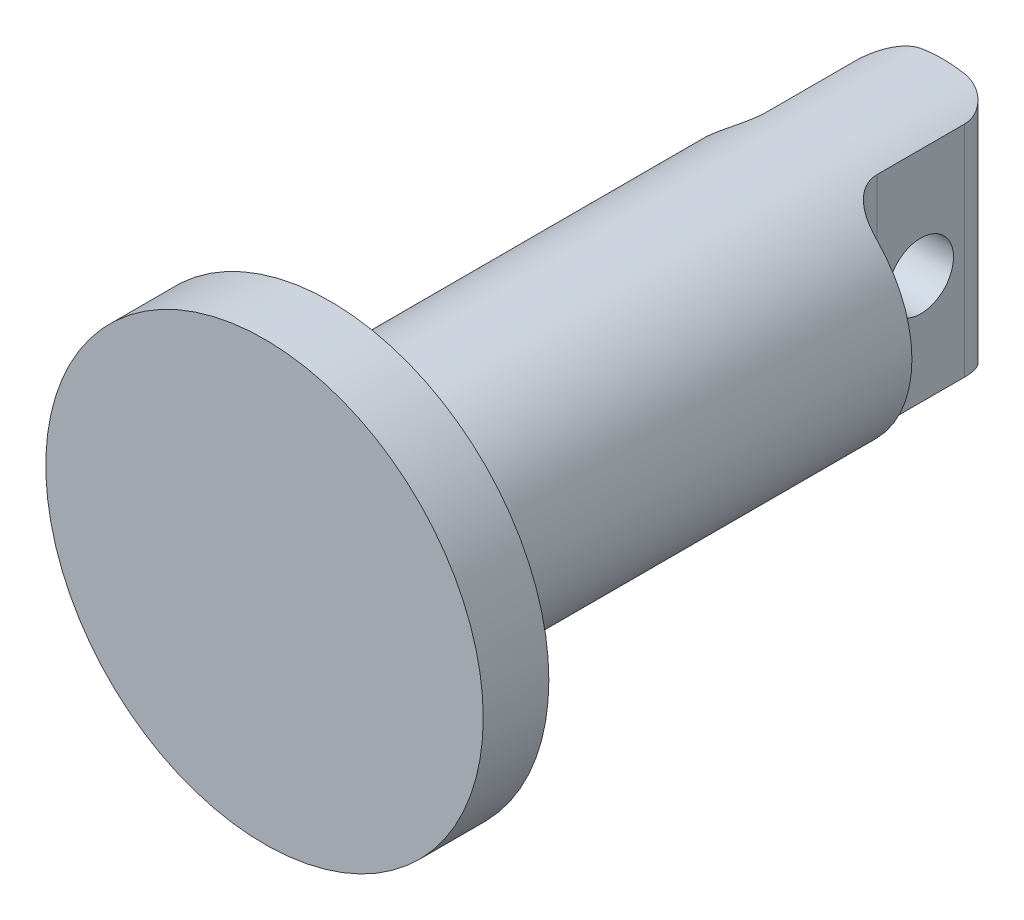
ISO-10303-21;
HEADER;
FILE_DESCRIPTION(('STEP AP214'),'2;1');
FILE_NAME('part.step','',(''),(''),'','','');
FILE_SCHEMA(('AUTOMOTIVE_DESIGN { 1 0 10303 214 1 1 1 1 }'));
ENDSEC;
DATA;
#1=APPLICATION_CONTEXT('core data for automotive mechanical design processes');
#2=APPLICATION_PROTOCOL_DEFINITION('international standard','automotive_design',2000,#1);
#3=PRODUCT_CONTEXT('',#1,'mechanical');
#4=PRODUCT('Part','Part','',(#3));
#5=PRODUCT_RELATED_PRODUCT_CATEGORY('part','',(#4));
#6=PRODUCT_DEFINITION_FORMATION('','',#4);
#7=PRODUCT_DEFINITION_CONTEXT('part definition',#1,'design');
#8=PRODUCT_DEFINITION('design','',#6,#7);
#9=PRODUCT_DEFINITION_SHAPE('','',#8);
#10=(LENGTH_UNIT() NAMED_UNIT(*) SI_UNIT(.MILLI.,.METRE.));
#11=(NAMED_UNIT(*) PLANE_ANGLE_UNIT() SI_UNIT($,.RADIAN.));
#12=(NAMED_UNIT(*) SI_UNIT($,.STERADIAN.) SOLID_ANGLE_UNIT());
#13=UNCERTAINTY_MEASURE_WITH_UNIT(LENGTH_MEASURE(1.E-05),#10,'distance_accuracy_value','');
#14=(GEOMETRIC_REPRESENTATION_CONTEXT(3) GLOBAL_UNCERTAINTY_ASSIGNED_CONTEXT((#13)) GLOBAL_UNIT_ASSIGNED_CONTEXT((#10,
#11,#12)) REPRESENTATION_CONTEXT('',''));
#15=CARTESIAN_POINT('',(0.,0.,0.));
#16=DIRECTION('',(0.,0.,1.));
#17=DIRECTION('',(1.,0.,0.));
#18=AXIS2_PLACEMENT_3D('',#15,#16,#17);
#19=CARTESIAN_POINT('',(0.,0.,0.));
#20=DIRECTION('',(0.,0.,1.));
#21=DIRECTION('',(1.,0.,0.));
#22=AXIS2_PLACEMENT_3D('',#19,#20,#21);
#23=PLANE('',#22);
#24=CARTESIAN_POINT('',(0.,0.,0.));
#25=DIRECTION('',(0.,0.,1.));
#26=DIRECTION('',(1.,0.,0.));
#27=AXIS2_PLACEMENT_3D('',#24,#25,#26);
#28=CIRCLE('',#27,8.6);
#29=CARTESIAN_POINT('',(8.6,0.,0.));
#30=VERTEX_POINT('',#29);
#31=EDGE_CURVE('E110',#30,#30,#28,.T.);
#32=ORIENTED_EDGE('',*,*,#31,.T.);
#33=EDGE_LOOP('',(#32));
#34=FACE_BOUND('',#33,.T.);
#35=CARTESIAN_POINT('',(0.,0.,0.));
#36=DIRECTION('',(0.,0.,1.));
#37=DIRECTION('',(1.,0.,0.));
#38=AXIS2_PLACEMENT_3D('',#35,#36,#37);
#39=CIRCLE('',#38,10.);
#40=CARTESIAN_POINT('',(10.,0.,0.));
#41=VERTEX_POINT('',#40);
#42=EDGE_CURVE('E242',#41,#41,#39,.T.);
#43=ORIENTED_EDGE('',*,*,#42,.F.);
#44=EDGE_LOOP('',(#43));
#45=FACE_BOUND('',#44,.T.);
#46=ADVANCED_FACE('F36',(#34,#45),#23,.F.);
#47=CARTESIAN_POINT('',(0.,0.,3.));
#48=DIRECTION('',(0.,0.,-1.));
#49=DIRECTION('',(-1.,0.,0.));
#50=AXIS2_PLACEMENT_3D('',#47,#48,#49);
#51=CYLINDRICAL_SURFACE('',#50,10.);
#52=CARTESIAN_POINT('',(0.,0.,3.));
#53=DIRECTION('',(0.,0.,1.));
#54=DIRECTION('',(1.,0.,0.));
#55=AXIS2_PLACEMENT_3D('',#52,#53,#54);
#56=CIRCLE('',#55,10.);
#57=CARTESIAN_POINT('',(10.,0.,3.));
#58=VERTEX_POINT('',#57);
#59=EDGE_CURVE('E363',#58,#58,#56,.T.);
#60=ORIENTED_EDGE('',*,*,#59,.F.);
#61=EDGE_LOOP('',(#60));
#62=FACE_BOUND('',#61,.T.);
#63=ORIENTED_EDGE('',*,*,#42,.T.);
#64=EDGE_LOOP('',(#63));
#65=FACE_BOUND('',#64,.T.);
#66=ADVANCED_FACE('F206',(#62,#65),#51,.T.);
#67=CARTESIAN_POINT('',(0.,0.,3.));
#68=DIRECTION('',(0.,0.,1.));
#69=DIRECTION('',(1.,0.,0.));
#70=AXIS2_PLACEMENT_3D('',#67,#68,#69);
#71=PLANE('',#70);
#72=ORIENTED_EDGE('',*,*,#59,.T.);
#73=EDGE_LOOP('',(#72));
#74=FACE_BOUND('',#73,.T.);
#75=ADVANCED_FACE('F155',(#74),#71,.T.);
#76=CARTESIAN_POINT('',(0.,0.,-28.));
#77=DIRECTION('',(0.,0.,1.));
#78=DIRECTION('',(1.,0.,0.));
#79=AXIS2_PLACEMENT_3D('',#76,#77,#78);
#80=CYLINDRICAL_SURFACE('',#79,5.6);
#81=CARTESIAN_POINT('',(0.,0.,-3.));
#82=DIRECTION('',(0.,0.,1.));
#83=DIRECTION('',(1.,0.,0.));
#84=AXIS2_PLACEMENT_3D('',#81,#82,#83);
#85=CIRCLE('',#84,5.6);
#86=CARTESIAN_POINT('',(5.6,0.,-3.));
#87=VERTEX_POINT('',#86);
#88=EDGE_CURVE('E125',#87,#87,#85,.F.);
#89=ORIENTED_EDGE('',*,*,#88,.T.);
#90=EDGE_LOOP('',(#89));
#91=FACE_BOUND('',#90,.T.);
#92=DIRECTION('',(0.,0.,1.));
#93=VECTOR('',#92,1.);
#94=CARTESIAN_POINT('',(-2.5,-5.01098792654702,-28.));
#95=LINE('',#94,#93);
#96=CARTESIAN_POINT('',(-2.5,-5.01098792654702,-22.5));
#97=VERTEX_POINT('',#96);
#98=CARTESIAN_POINT('',(-2.5,-5.01098792654702,-26.5));
#99=VERTEX_POINT('',#98);
#100=EDGE_CURVE('E108',#97,#99,#95,.F.);
#101=ORIENTED_EDGE('',*,*,#100,.T.);
#102=CARTESIAN_POINT('',(-2.5,-5.01098792654702,-26.5));
#103=CARTESIAN_POINT('',(-2.5000020804932,-5.01098386540568,-26.5395725011254));
#104=CARTESIAN_POINT('',(-2.49843294481036,-5.01177002350182,-26.5791239922962));
#105=CARTESIAN_POINT('',(-2.49218861536451,-5.01487928972236,-26.6579048751711));
#106=CARTESIAN_POINT('',(-2.48751464530948,-5.017201792326,-26.6971343876123));
#107=CARTESIAN_POINT('',(-2.46895310911888,-5.02637746679336,-26.8135594581204));
#108=CARTESIAN_POINT('',(-2.45052502289085,-5.03543974754558,-26.88991104718));
#109=CARTESIAN_POINT('',(-2.40237161237888,-5.05858790620674,-27.0379794446277));
#110=CARTESIAN_POINT('',(-2.37265886624782,-5.07266818985616,-27.1097013096591));
#111=CARTESIAN_POINT('',(-2.30298371585328,-5.10467755632711,-27.2471099442359));
#112=CARTESIAN_POINT('',(-2.2630111953227,-5.12261043499499,-27.312790669817));
#113=CARTESIAN_POINT('',(-2.17141281857219,-5.16213023737658,-27.4403776451357));
#114=CARTESIAN_POINT('',(-2.11924950501062,-5.18386787648468,-27.5018504279728));
#115=CARTESIAN_POINT('',(-2.00607340449965,-5.22870677700186,-27.615459784027));
#116=CARTESIAN_POINT('',(-1.94505678929908,-5.25180862573225,-27.6675922965179));
#117=CARTESIAN_POINT('',(-1.81019268688119,-5.29987993214784,-27.7653363169122));
#118=CARTESIAN_POINT('',(-1.73570424955865,-5.32484780646085,-27.8100673581615));
#119=CARTESIAN_POINT('',(-1.57974465073417,-5.37317998442629,-27.886151142896));
#120=CARTESIAN_POINT('',(-1.49827861035609,-5.39654544185285,-27.9175135987391));
#121=CARTESIAN_POINT('',(-1.34760565609259,-5.43587189487601,-27.960819199001));
#122=CARTESIAN_POINT('',(-1.27929438996599,-5.45237039149003,-27.9754206613721));
#123=CARTESIAN_POINT('',(-1.14076362477681,-5.48304543588229,-27.9950256519124));
#124=CARTESIAN_POINT('',(-1.07054304586715,-5.49722063643315,-28.0000236291209));
#125=CARTESIAN_POINT('',(-1.,-5.50999092558236,-28.));
#126=B_SPLINE_CURVE_WITH_KNOTS('',3,(#102,#103,#104,#105,#106,#107,#108,#109,#110,#111,#112,
#113,#114,#115,#116,#117,#118,#119,#120,#121,#122,#123,#124,#125),.UNSPECIFIED.,.F.,.F.,(4,2,2,
2,2,2,2,2,2,2,2,4),(0.,0.118637964226892,0.237229197409221,0.473170501747675,0.708849588412842,
0.944761956370705,1.19422423603551,1.44379470880183,1.7137504722233,1.98350977549837,
2.19815830777773,2.41293087289718),.UNSPECIFIED.);
#127=CARTESIAN_POINT('',(-1.,-5.50999092558236,-28.));
#128=VERTEX_POINT('',#127);
#129=EDGE_CURVE('E171',#99,#128,#126,.T.);
#130=ORIENTED_EDGE('',*,*,#129,.T.);
#131=CARTESIAN_POINT('',(0.,0.,-28.));
#132=DIRECTION('',(0.,0.,-1.));
#133=DIRECTION('',(-1.,0.,0.));
#134=AXIS2_PLACEMENT_3D('',#131,#132,#133);
#135=CIRCLE('',#134,5.6);
#136=CARTESIAN_POINT('',(1.,-5.50999092558236,-28.));
#137=VERTEX_POINT('',#136);
#138=EDGE_CURVE('E243',#137,#128,#135,.T.);
#139=ORIENTED_EDGE('',*,*,#138,.F.);
#140=CARTESIAN_POINT('',(1.,-5.50999092558236,-28.));
#141=CARTESIAN_POINT('',(1.0431357750744,-5.50216525904986,-28.0000002889022));
#142=CARTESIAN_POINT('',(1.08615359317973,-5.49383123010131,-27.9981384460265));
#143=CARTESIAN_POINT('',(1.17166685141476,-5.47623015731936,-27.9907624586411));
#144=CARTESIAN_POINT('',(1.21416247296195,-5.46696344841963,-27.9852496212957));
#145=CARTESIAN_POINT('',(1.3401887639641,-5.43794852352108,-27.9633914739219));
#146=CARTESIAN_POINT('',(1.42256390588289,-5.41692970323941,-27.9417254477834));
#147=CARTESIAN_POINT('',(1.58180278663491,-5.37259209995911,-27.8851540203785));
#148=CARTESIAN_POINT('',(1.65867169675423,-5.34927552517556,-27.8502612403694));
#149=CARTESIAN_POINT('',(1.80531751706315,-5.30158259710547,-27.7682756767982));
#150=CARTESIAN_POINT('',(1.87508918255689,-5.2772054788231,-27.7211739610188));
#151=CARTESIAN_POINT('',(2.00835566901939,-5.22797720762672,-27.6139160966464));
#152=CARTESIAN_POINT('',(2.07151596208769,-5.20314268003664,-27.5533357924905));
#153=CARTESIAN_POINT('',(2.18673797636213,-5.15577972730389,-27.4215791801319));
#154=CARTESIAN_POINT('',(2.23879824157279,-5.1332516048946,-27.3504014839417));
#155=CARTESIAN_POINT('',(2.32948785162619,-5.0927330594954,-27.2000525597936));
#156=CARTESIAN_POINT('',(2.36827835891485,-5.07468897321799,-27.1209935103895));
#157=CARTESIAN_POINT('',(2.43160009913251,-5.04465718708589,-26.9563554350108));
#158=CARTESIAN_POINT('',(2.45616029662659,-5.03265719156463,-26.8707900567923));
#159=CARTESIAN_POINT('',(2.48193557874058,-5.01996911315989,-26.7369083960247));
#160=CARTESIAN_POINT('',(2.48869640698838,-5.01661546402954,-26.6898457537173));
#161=CARTESIAN_POINT('',(2.49773104489937,-5.01212031245242,-26.5951999860403));
#162=CARTESIAN_POINT('',(2.50000596090449,-5.01097826456884,-26.5476169919148));
#163=CARTESIAN_POINT('',(2.5,-5.01098792654702,-26.5));
#164=B_SPLINE_CURVE_WITH_KNOTS('',3,(#140,#141,#142,#143,#144,#145,#146,#147,#148,#149,#150,
#151,#152,#153,#154,#155,#156,#157,#158,#159,#160,#161,#162,#163),.UNSPECIFIED.,.F.,.F.,(4,2,2,
2,2,2,2,2,2,2,2,4),(0.,0.131429504807568,0.262811979376038,0.524658963023519,0.786256712976935,
1.04804639414124,1.31967659915426,1.59134241212977,1.85958079849224,2.12727127325902,
2.27002499369473,2.4127435029665),.UNSPECIFIED.);
#165=CARTESIAN_POINT('',(2.5,-5.01098792654702,-26.5));
#166=VERTEX_POINT('',#165);
#167=EDGE_CURVE('E133',#137,#166,#164,.T.);
#168=ORIENTED_EDGE('',*,*,#167,.T.);
#169=DIRECTION('',(0.,0.,1.));
#170=VECTOR('',#169,1.);
#171=CARTESIAN_POINT('',(2.5,-5.01098792654702,-28.));
#172=LINE('',#171,#170);
#173=CARTESIAN_POINT('',(2.5,-5.01098792654702,-22.5));
#174=VERTEX_POINT('',#173);
#175=EDGE_CURVE('E120',#166,#174,#172,.T.);
#176=ORIENTED_EDGE('',*,*,#175,.T.);
#177=CARTESIAN_POINT('',(2.5,-5.01098792654702,-22.5));
#178=CARTESIAN_POINT('',(2.49999844532188,-5.01098605975963,-22.4616087248729));
#179=CARTESIAN_POINT('',(2.50147503292777,-5.01025231108213,-22.4232363931987));
#180=CARTESIAN_POINT('',(2.50735348108305,-5.00731410603619,-22.3467785175572));
#181=CARTESIAN_POINT('',(2.51175493108791,-5.00510985607259,-22.3086929340996));
#182=CARTESIAN_POINT('',(2.52926194656355,-4.99630013425496,-22.1954739584162));
#183=CARTESIAN_POINT('',(2.54667063879383,-4.98749773902104,-22.1211207884798));
#184=CARTESIAN_POINT('',(2.59216946245848,-4.96400076184108,-21.9767905047417));
#185=CARTESIAN_POINT('',(2.62026021251362,-4.94930583864348,-21.9068136446547));
#186=CARTESIAN_POINT('',(2.68583584980902,-4.91402750126924,-21.7730039536221));
#187=CARTESIAN_POINT('',(2.72332327114746,-4.89344249844124,-21.709172786487));
#188=CARTESIAN_POINT('',(2.80690028343339,-4.8459942461289,-21.5878278514886));
#189=CARTESIAN_POINT('',(2.85315683574015,-4.81900603636376,-21.5304785632747));
#190=CARTESIAN_POINT('',(2.95167990030185,-4.75929602991547,-21.4247089164592));
#191=CARTESIAN_POINT('',(3.00394464051543,-4.72657592230139,-21.3762859360669));
#192=CARTESIAN_POINT('',(3.11692455378362,-4.65292232365463,-21.2851460559756));
#193=CARTESIAN_POINT('',(3.1779812305425,-4.61153525982092,-21.2432230603618));
#194=CARTESIAN_POINT('',(3.30259788637748,-4.52312917531629,-21.1700105708581));
#195=CARTESIAN_POINT('',(3.36616437104541,-4.476094772014,-21.1387510539356));
#196=CARTESIAN_POINT('',(3.47863230154504,-4.38895526792786,-21.0925366978604));
#197=CARTESIAN_POINT('',(3.52745519326801,-4.34983358810063,-21.0754750754576));
#198=CARTESIAN_POINT('',(3.624733043728,-4.26911086138937,-21.0468148597547));
#199=CARTESIAN_POINT('',(3.67318758591487,-4.2275073753211,-21.0352217441161));
#200=CARTESIAN_POINT('',(3.76886997937974,-4.14242568117838,-21.0171181181185));
#201=CARTESIAN_POINT('',(3.8161032057753,-4.09895936269225,-21.0105793259212));
#202=CARTESIAN_POINT('',(3.90916509774067,-4.01030876341671,-21.0020267392921));
#203=CARTESIAN_POINT('',(3.95499655700509,-3.96512836484636,-21.0000032754364));
#204=CARTESIAN_POINT('',(4.,-3.91918358845308,-21.));
#205=B_SPLINE_CURVE_WITH_KNOTS('',3,(#177,#178,#179,#180,#181,#182,#183,#184,#185,#186,#187,
#188,#189,#190,#191,#192,#193,#194,#195,#196,#197,#198,#199,#200,#201,#202,#203,#204),
.UNSPECIFIED.,.F.,.F.,(4,2,2,2,2,2,2,2,2,2,2,2,2,4),(0.,0.115101046934983,0.230185941272074,
0.459593197899067,0.689013742013863,0.918496223045591,1.15289102850619,1.38721687860824,
1.64076447615015,1.8950190787028,2.089284445406,2.28374399162558,2.47710738617681,
2.6700563005188),.UNSPECIFIED.);
#206=CARTESIAN_POINT('',(4.,-3.91918358845308,-21.));
#207=VERTEX_POINT('',#206);
#208=EDGE_CURVE('E12',#174,#207,#205,.T.);
#209=ORIENTED_EDGE('',*,*,#208,.T.);
#210=CARTESIAN_POINT('',(0.,0.,-21.));
#211=DIRECTION('',(0.,0.,-1.));
#212=DIRECTION('',(-1.,0.,0.));
#213=AXIS2_PLACEMENT_3D('',#210,#211,#212);
#214=CIRCLE('',#213,5.6);
#215=CARTESIAN_POINT('',(4.,3.91918358845308,-21.));
#216=VERTEX_POINT('',#215);
#217=EDGE_CURVE('E123',#216,#207,#214,.T.);
#218=ORIENTED_EDGE('',*,*,#217,.F.);
#219=CARTESIAN_POINT('',(4.,3.91918358845308,-21.));
#220=CARTESIAN_POINT('',(3.9557336803865,3.96437492473145,-21.0000033469822));
#221=CARTESIAN_POINT('',(3.91066820298925,4.00882603571216,-21.001960904263));
#222=CARTESIAN_POINT('',(3.81918676707573,4.09607014262874,-21.0102269052185));
#223=CARTESIAN_POINT('',(3.77276836887405,4.1388597710828,-21.0165437429517));
#224=CARTESIAN_POINT('',(3.67865738367702,4.22273424589004,-21.0340382842501));
#225=CARTESIAN_POINT('',(3.63095793272987,4.26380422561554,-21.0452514247408));
#226=CARTESIAN_POINT('',(3.53517126489213,4.34355264612186,-21.0729679651696));
#227=CARTESIAN_POINT('',(3.48708440180229,4.38223303908223,-21.0894669767605));
#228=CARTESIAN_POINT('',(3.36770023341093,4.47512441155301,-21.1376084788785));
#229=CARTESIAN_POINT('',(3.29649458651222,4.52773396683387,-21.1727131624566));
#230=CARTESIAN_POINT('',(3.15741936012218,4.62578965948223,-21.2563691011738));
#231=CARTESIAN_POINT('',(3.08954041268094,4.67125681502645,-21.3048796978459));
#232=CARTESIAN_POINT('',(2.95967539347949,4.75461124064817,-21.4159885788762));
#233=CARTESIAN_POINT('',(2.8977435397363,4.7924317165616,-21.4787016416199));
#234=CARTESIAN_POINT('',(2.7841641032247,4.85930002163556,-21.6169749042305));
#235=CARTESIAN_POINT('',(2.73251858454951,4.88834609069483,-21.6925376769387));
#236=CARTESIAN_POINT('',(2.64857801238486,4.9342724729647,-21.844085980049));
#237=CARTESIAN_POINT('',(2.6146816186877,4.95221168523887,-21.918868913277));
#238=CARTESIAN_POINT('',(2.55937136974278,4.98102422435756,-22.074143720394));
#239=CARTESIAN_POINT('',(2.5379390462439,4.99190800812404,-22.1546269485125));
#240=CARTESIAN_POINT('',(2.51557298798128,5.00319512688941,-22.2799333289134));
#241=CARTESIAN_POINT('',(2.5097391768057,5.00612014491925,-22.3237216604271));
#242=CARTESIAN_POINT('',(2.50195365053542,5.01001359195367,-22.4116649506208));
#243=CARTESIAN_POINT('',(2.49999639781366,5.01098481197141,-22.4558192957153));
#244=CARTESIAN_POINT('',(2.5,5.01098792654702,-22.5));
#245=B_SPLINE_CURVE_WITH_KNOTS('',3,(#219,#220,#221,#222,#223,#224,#225,#226,#227,#228,#229,
#230,#231,#232,#233,#234,#235,#236,#237,#238,#239,#240,#241,#242,#243,#244),.UNSPECIFIED.,.F.,
.F.,(4,2,2,2,2,2,2,2,2,2,2,2,4),(0.,0.189784007279752,0.379934478566911,0.571484582290015,
0.762876070802287,1.04739762955487,1.33106556508882,1.61711342007846,1.90321861676456,
2.15402154935302,2.40445190932844,2.53707794764393,2.66951439388349),.UNSPECIFIED.);
#246=CARTESIAN_POINT('',(2.5,5.01098792654702,-22.5));
#247=VERTEX_POINT('',#246);
#248=EDGE_CURVE('E49',#216,#247,#245,.T.);
#249=ORIENTED_EDGE('',*,*,#248,.T.);
#250=DIRECTION('',(0.,0.,1.));
#251=VECTOR('',#250,1.);
#252=CARTESIAN_POINT('',(2.5,5.01098792654702,-28.));
#253=LINE('',#252,#251);
#254=CARTESIAN_POINT('',(2.5,5.01098792654702,-26.5));
#255=VERTEX_POINT('',#254);
#256=EDGE_CURVE('E235',#247,#255,#253,.F.);
#257=ORIENTED_EDGE('',*,*,#256,.T.);
#258=CARTESIAN_POINT('',(2.5,5.01098792654702,-26.5));
#259=CARTESIAN_POINT('',(2.5000020804932,5.01098386540568,-26.5395725011254));
#260=CARTESIAN_POINT('',(2.49843294481036,5.01177002350182,-26.5791239922962));
#261=CARTESIAN_POINT('',(2.49218861536451,5.01487928972236,-26.6579048751711));
#262=CARTESIAN_POINT('',(2.48751464530948,5.017201792326,-26.6971343876123));
#263=CARTESIAN_POINT('',(2.46895310911888,5.02637746679336,-26.8135594581204));
#264=CARTESIAN_POINT('',(2.45052502289085,5.03543974754558,-26.88991104718));
#265=CARTESIAN_POINT('',(2.40237161237888,5.05858790620674,-27.0379794446277));
#266=CARTESIAN_POINT('',(2.37265886624782,5.07266818985616,-27.1097013096591));
#267=CARTESIAN_POINT('',(2.30298371585328,5.10467755632711,-27.2471099442359));
#268=CARTESIAN_POINT('',(2.2630111953227,5.12261043499499,-27.312790669817));
#269=CARTESIAN_POINT('',(2.17141281857219,5.16213023737658,-27.4403776451357));
#270=CARTESIAN_POINT('',(2.11924950501062,5.18386787648468,-27.5018504279728));
#271=CARTESIAN_POINT('',(2.00607340449965,5.22870677700186,-27.615459784027));
#272=CARTESIAN_POINT('',(1.94505678929908,5.25180862573225,-27.6675922965179));
#273=CARTESIAN_POINT('',(1.81019268688119,5.29987993214784,-27.7653363169122));
#274=CARTESIAN_POINT('',(1.73570424955865,5.32484780646085,-27.8100673581615));
#275=CARTESIAN_POINT('',(1.57974465073417,5.37317998442629,-27.886151142896));
#276=CARTESIAN_POINT('',(1.49827861035609,5.39654544185285,-27.9175135987391));
#277=CARTESIAN_POINT('',(1.34760565609259,5.43587189487601,-27.960819199001));
#278=CARTESIAN_POINT('',(1.27929438996599,5.45237039149003,-27.9754206613721));
#279=CARTESIAN_POINT('',(1.14076362477681,5.48304543588229,-27.9950256519124));
#280=CARTESIAN_POINT('',(1.07054304586715,5.49722063643315,-28.0000236291209));
#281=CARTESIAN_POINT('',(1.,5.50999092558236,-28.));
#282=B_SPLINE_CURVE_WITH_KNOTS('',3,(#258,#259,#260,#261,#262,#263,#264,#265,#266,#267,#268,
#269,#270,#271,#272,#273,#274,#275,#276,#277,#278,#279,#280,#281),.UNSPECIFIED.,.F.,.F.,(4,2,2,
2,2,2,2,2,2,2,2,4),(0.,0.118637964226892,0.237229197409221,0.473170501747675,0.708849588412842,
0.944761956370705,1.19422423603551,1.44379470880183,1.7137504722233,1.98350977549837,
2.19815830777773,2.41293087289718),.UNSPECIFIED.);
#283=CARTESIAN_POINT('',(1.,5.50999092558236,-28.));
#284=VERTEX_POINT('',#283);
#285=EDGE_CURVE('E140',#255,#284,#282,.T.);
#286=ORIENTED_EDGE('',*,*,#285,.T.);
#287=CARTESIAN_POINT('',(-1.,5.50999092558236,-28.));
#288=VERTEX_POINT('',#287);
#289=EDGE_CURVE('E233',#288,#284,#135,.T.);
#290=ORIENTED_EDGE('',*,*,#289,.F.);
#291=CARTESIAN_POINT('',(-1.,5.50999092558236,-28.));
#292=CARTESIAN_POINT('',(-1.0431357750744,5.50216525904986,-28.0000002889022));
#293=CARTESIAN_POINT('',(-1.08615359317973,5.49383123010131,-27.9981384460265));
#294=CARTESIAN_POINT('',(-1.17166685141476,5.47623015731936,-27.9907624586411));
#295=CARTESIAN_POINT('',(-1.21416247296195,5.46696344841963,-27.9852496212957));
#296=CARTESIAN_POINT('',(-1.3401887639641,5.43794852352108,-27.9633914739219));
#297=CARTESIAN_POINT('',(-1.42256390588289,5.41692970323941,-27.9417254477834));
#298=CARTESIAN_POINT('',(-1.58180278663491,5.37259209995911,-27.8851540203785));
#299=CARTESIAN_POINT('',(-1.65867169675423,5.34927552517556,-27.8502612403694));
#300=CARTESIAN_POINT('',(-1.80531751706315,5.30158259710547,-27.7682756767982));
#301=CARTESIAN_POINT('',(-1.87508918255689,5.2772054788231,-27.7211739610188));
#302=CARTESIAN_POINT('',(-2.00835566901939,5.22797720762672,-27.6139160966464));
#303=CARTESIAN_POINT('',(-2.07151596208769,5.20314268003664,-27.5533357924905));
#304=CARTESIAN_POINT('',(-2.18673797636213,5.15577972730389,-27.4215791801319));
#305=CARTESIAN_POINT('',(-2.23879824157279,5.1332516048946,-27.3504014839417));
#306=CARTESIAN_POINT('',(-2.32948785162619,5.0927330594954,-27.2000525597936));
#307=CARTESIAN_POINT('',(-2.36827835891485,5.07468897321799,-27.1209935103895));
#308=CARTESIAN_POINT('',(-2.43160009913251,5.04465718708589,-26.9563554350108));
#309=CARTESIAN_POINT('',(-2.45616029662659,5.03265719156463,-26.8707900567923));
#310=CARTESIAN_POINT('',(-2.48193557874058,5.01996911315989,-26.7369083960247));
#311=CARTESIAN_POINT('',(-2.48869640698838,5.01661546402954,-26.6898457537173));
#312=CARTESIAN_POINT('',(-2.49773104489937,5.01212031245242,-26.5951999860403));
#313=CARTESIAN_POINT('',(-2.50000596090449,5.01097826456884,-26.5476169919148));
#314=CARTESIAN_POINT('',(-2.5,5.01098792654702,-26.5));
#315=B_SPLINE_CURVE_WITH_KNOTS('',3,(#291,#292,#293,#294,#295,#296,#297,#298,#299,#300,#301,
#302,#303,#304,#305,#306,#307,#308,#309,#310,#311,#312,#313,#314),.UNSPECIFIED.,.F.,.F.,(4,2,2,
2,2,2,2,2,2,2,2,4),(0.,0.131429504807568,0.262811979376038,0.524658963023519,0.786256712976935,
1.04804639414124,1.31967659915426,1.59134241212977,1.85958079849224,2.12727127325902,
2.27002499369473,2.4127435029665),.UNSPECIFIED.);
#316=CARTESIAN_POINT('',(-2.5,5.01098792654702,-26.5));
#317=VERTEX_POINT('',#316);
#318=EDGE_CURVE('E164',#288,#317,#315,.T.);
#319=ORIENTED_EDGE('',*,*,#318,.T.);
#320=DIRECTION('',(0.,0.,1.));
#321=VECTOR('',#320,1.);
#322=CARTESIAN_POINT('',(-2.5,5.01098792654702,-28.));
#323=LINE('',#322,#321);
#324=CARTESIAN_POINT('',(-2.5,5.01098792654702,-22.5));
#325=VERTEX_POINT('',#324);
#326=EDGE_CURVE('E119',#317,#325,#323,.T.);
#327=ORIENTED_EDGE('',*,*,#326,.T.);
#328=CARTESIAN_POINT('',(-2.5,5.01098792654702,-22.5));
#329=CARTESIAN_POINT('',(-2.49999844532188,5.01098605975963,-22.4616087248729));
#330=CARTESIAN_POINT('',(-2.50147503292777,5.01025231108213,-22.4232363931987));
#331=CARTESIAN_POINT('',(-2.50735348108305,5.00731410603619,-22.3467785175572));
#332=CARTESIAN_POINT('',(-2.51175493108791,5.00510985607259,-22.3086929340996));
#333=CARTESIAN_POINT('',(-2.52926194656355,4.99630013425496,-22.1954739584162));
#334=CARTESIAN_POINT('',(-2.54667063879383,4.98749773902104,-22.1211207884798));
#335=CARTESIAN_POINT('',(-2.59216946245848,4.96400076184108,-21.9767905047417));
#336=CARTESIAN_POINT('',(-2.62026021251362,4.94930583864348,-21.9068136446547));
#337=CARTESIAN_POINT('',(-2.68583584980902,4.91402750126924,-21.7730039536221));
#338=CARTESIAN_POINT('',(-2.72332327114746,4.89344249844124,-21.709172786487));
#339=CARTESIAN_POINT('',(-2.80690028343339,4.8459942461289,-21.5878278514886));
#340=CARTESIAN_POINT('',(-2.85315683574015,4.81900603636376,-21.5304785632747));
#341=CARTESIAN_POINT('',(-2.95167990030185,4.75929602991547,-21.4247089164592));
#342=CARTESIAN_POINT('',(-3.00394464051543,4.72657592230139,-21.3762859360669));
#343=CARTESIAN_POINT('',(-3.11692455378362,4.65292232365463,-21.2851460559756));
#344=CARTESIAN_POINT('',(-3.1779812305425,4.61153525982092,-21.2432230603618));
#345=CARTESIAN_POINT('',(-3.30259788637748,4.52312917531629,-21.1700105708581));
#346=CARTESIAN_POINT('',(-3.36616437104541,4.476094772014,-21.1387510539356));
#347=CARTESIAN_POINT('',(-3.47863230154504,4.38895526792786,-21.0925366978604));
#348=CARTESIAN_POINT('',(-3.52745519326801,4.34983358810063,-21.0754750754576));
#349=CARTESIAN_POINT('',(-3.624733043728,4.26911086138937,-21.0468148597547));
#350=CARTESIAN_POINT('',(-3.67318758591487,4.2275073753211,-21.0352217441161));
#351=CARTESIAN_POINT('',(-3.76886997937974,4.14242568117838,-21.0171181181185));
#352=CARTESIAN_POINT('',(-3.8161032057753,4.09895936269225,-21.0105793259212));
#353=CARTESIAN_POINT('',(-3.90916509774067,4.01030876341671,-21.0020267392921));
#354=CARTESIAN_POINT('',(-3.95499655700509,3.96512836484636,-21.0000032754364));
#355=CARTESIAN_POINT('',(-4.,3.91918358845308,-21.));
#356=B_SPLINE_CURVE_WITH_KNOTS('',3,(#328,#329,#330,#331,#332,#333,#334,#335,#336,#337,#338,
#339,#340,#341,#342,#343,#344,#345,#346,#347,#348,#349,#350,#351,#352,#353,#354,#355),
.UNSPECIFIED.,.F.,.F.,(4,2,2,2,2,2,2,2,2,2,2,2,2,4),(0.,0.115101046934983,0.230185941272074,
0.459593197899067,0.689013742013863,0.918496223045591,1.15289102850619,1.38721687860824,
1.64076447615015,1.8950190787028,2.089284445406,2.28374399162558,2.47710738617681,
2.6700563005188),.UNSPECIFIED.);
#357=CARTESIAN_POINT('',(-4.,3.91918358845308,-21.));
#358=VERTEX_POINT('',#357);
#359=EDGE_CURVE('E64',#325,#358,#356,.T.);
#360=ORIENTED_EDGE('',*,*,#359,.T.);
#361=CARTESIAN_POINT('',(0.,0.,-21.));
#362=DIRECTION('',(0.,0.,1.));
#363=DIRECTION('',(1.,0.,0.));
#364=AXIS2_PLACEMENT_3D('',#361,#362,#363);
#365=CIRCLE('',#364,5.6);
#366=CARTESIAN_POINT('',(-4.,-3.91918358845308,-21.));
#367=VERTEX_POINT('',#366);
#368=EDGE_CURVE('E109',#358,#367,#365,.T.);
#369=ORIENTED_EDGE('',*,*,#368,.T.);
#370=CARTESIAN_POINT('',(-4.,-3.91918358845308,-21.));
#371=CARTESIAN_POINT('',(-3.9557336803865,-3.96437492473145,-21.0000033469822));
#372=CARTESIAN_POINT('',(-3.91066820298925,-4.00882603571216,-21.001960904263));
#373=CARTESIAN_POINT('',(-3.81918676707573,-4.09607014262874,-21.0102269052185));
#374=CARTESIAN_POINT('',(-3.77276836887405,-4.1388597710828,-21.0165437429517));
#375=CARTESIAN_POINT('',(-3.67865738367702,-4.22273424589004,-21.0340382842501));
#376=CARTESIAN_POINT('',(-3.63095793272987,-4.26380422561554,-21.0452514247408));
#377=CARTESIAN_POINT('',(-3.53517126489213,-4.34355264612186,-21.0729679651696));
#378=CARTESIAN_POINT('',(-3.48708440180229,-4.38223303908223,-21.0894669767605));
#379=CARTESIAN_POINT('',(-3.36770023341093,-4.47512441155301,-21.1376084788785));
#380=CARTESIAN_POINT('',(-3.29649458651222,-4.52773396683387,-21.1727131624566));
#381=CARTESIAN_POINT('',(-3.15741936012218,-4.62578965948223,-21.2563691011738));
#382=CARTESIAN_POINT('',(-3.08954041268094,-4.67125681502645,-21.3048796978459));
#383=CARTESIAN_POINT('',(-2.95967539347949,-4.75461124064817,-21.4159885788762));
#384=CARTESIAN_POINT('',(-2.8977435397363,-4.7924317165616,-21.4787016416199));
#385=CARTESIAN_POINT('',(-2.7841641032247,-4.85930002163556,-21.6169749042305));
#386=CARTESIAN_POINT('',(-2.73251858454951,-4.88834609069483,-21.6925376769387));
#387=CARTESIAN_POINT('',(-2.64857801238486,-4.9342724729647,-21.844085980049));
#388=CARTESIAN_POINT('',(-2.6146816186877,-4.95221168523887,-21.918868913277));
#389=CARTESIAN_POINT('',(-2.55937136974278,-4.98102422435756,-22.074143720394));
#390=CARTESIAN_POINT('',(-2.5379390462439,-4.99190800812404,-22.1546269485125));
#391=CARTESIAN_POINT('',(-2.51557298798128,-5.00319512688941,-22.2799333289134));
#392=CARTESIAN_POINT('',(-2.5097391768057,-5.00612014491925,-22.3237216604271));
#393=CARTESIAN_POINT('',(-2.50195365053542,-5.01001359195367,-22.4116649506208));
#394=CARTESIAN_POINT('',(-2.49999639781366,-5.01098481197141,-22.4558192957153));
#395=CARTESIAN_POINT('',(-2.5,-5.01098792654702,-22.5));
#396=B_SPLINE_CURVE_WITH_KNOTS('',3,(#370,#371,#372,#373,#374,#375,#376,#377,#378,#379,#380,
#381,#382,#383,#384,#385,#386,#387,#388,#389,#390,#391,#392,#393,#394,#395),.UNSPECIFIED.,.F.,
.F.,(4,2,2,2,2,2,2,2,2,2,2,2,4),(0.,0.189784007279752,0.379934478566911,0.571484582290015,
0.762876070802287,1.04739762955487,1.33106556508882,1.61711342007846,1.90321861676456,
2.15402154935302,2.40445190932844,2.53707794764393,2.66951439388349),.UNSPECIFIED.);
#397=EDGE_CURVE('E56',#367,#97,#396,.T.);
#398=ORIENTED_EDGE('',*,*,#397,.T.);
#399=EDGE_LOOP('',(#101,#130,#139,#168,#176,#209,#218,#249,#257,#286,#290,#319,#327,#360,#369,#398));
#400=FACE_BOUND('',#399,.T.);
#401=ADVANCED_FACE('F107',(#91,#400),#80,.T.);
#402=CARTESIAN_POINT('',(0.,0.,-28.));
#403=DIRECTION('',(0.,0.,-1.));
#404=DIRECTION('',(-1.,0.,0.));
#405=AXIS2_PLACEMENT_3D('',#402,#403,#404);
#406=PLANE('',#405);
#407=ORIENTED_EDGE('',*,*,#138,.T.);
#408=DIRECTION('',(0.,-1.,0.));
#409=VECTOR('',#408,1.);
#410=CARTESIAN_POINT('',(-1.,5.01098792654702,-28.));
#411=LINE('',#410,#409);
#412=EDGE_CURVE('E228',#128,#288,#411,.F.);
#413=ORIENTED_EDGE('',*,*,#412,.T.);
#414=ORIENTED_EDGE('',*,*,#289,.T.);
#415=DIRECTION('',(0.,1.,0.));
#416=VECTOR('',#415,1.);
#417=CARTESIAN_POINT('',(1.,-5.01098792654702,-28.));
#418=LINE('',#417,#416);
#419=EDGE_CURVE('E230',#284,#137,#418,.F.);
#420=ORIENTED_EDGE('',*,*,#419,.T.);
#421=EDGE_LOOP('',(#407,#413,#414,#420));
#422=FACE_BOUND('',#421,.T.);
#423=ADVANCED_FACE('F154',(#422),#406,.T.);
#424=CARTESIAN_POINT('',(-0.625761910770769,-0.537352555701064,-21.));
#425=DIRECTION('',(0.,0.,1.));
#426=DIRECTION('',(1.,0.,0.));
#427=AXIS2_PLACEMENT_3D('',#424,#425,#426);
#428=PLANE('',#427);
#429=ORIENTED_EDGE('',*,*,#368,.F.);
#430=DIRECTION('',(0.,-1.,0.));
#431=VECTOR('',#430,1.);
#432=CARTESIAN_POINT('',(-4.,-5.01098792654702,-21.));
#433=LINE('',#432,#431);
#434=EDGE_CURVE('E252',#358,#367,#433,.T.);
#435=ORIENTED_EDGE('',*,*,#434,.T.);
#436=EDGE_LOOP('',(#429,#435));
#437=FACE_BOUND('',#436,.T.);
#438=ADVANCED_FACE('F311',(#437),#428,.F.);
#439=CARTESIAN_POINT('',(-2.5,0.,-21.));
#440=DIRECTION('',(1.,0.,0.));
#441=DIRECTION('',(0.,0.,-1.));
#442=AXIS2_PLACEMENT_3D('',#439,#440,#441);
#443=PLANE('',#442);
#444=CARTESIAN_POINT('',(-2.5,0.,-24.5));
#445=DIRECTION('',(1.,0.,0.));
#446=DIRECTION('',(0.,0.,-1.));
#447=AXIS2_PLACEMENT_3D('',#444,#445,#446);
#448=CIRCLE('',#447,1.5);
#449=CARTESIAN_POINT('',(-2.5,0.,-26.));
#450=VERTEX_POINT('',#449);
#451=EDGE_CURVE('E372',#450,#450,#448,.F.);
#452=ORIENTED_EDGE('',*,*,#451,.F.);
#453=EDGE_LOOP('',(#452));
#454=FACE_BOUND('',#453,.T.);
#455=ORIENTED_EDGE('',*,*,#326,.F.);
#456=DIRECTION('',(0.,-1.,0.));
#457=VECTOR('',#456,1.);
#458=CARTESIAN_POINT('',(-2.5,-5.01098792654702,-26.5));
#459=LINE('',#458,#457);
#460=EDGE_CURVE('E118',#317,#99,#459,.T.);
#461=ORIENTED_EDGE('',*,*,#460,.T.);
#462=ORIENTED_EDGE('',*,*,#100,.F.);
#463=DIRECTION('',(0.,-1.,0.));
#464=VECTOR('',#463,1.);
#465=CARTESIAN_POINT('',(-2.5,5.01098792654702,-22.5));
#466=LINE('',#465,#464);
#467=EDGE_CURVE('E116',#97,#325,#466,.F.);
#468=ORIENTED_EDGE('',*,*,#467,.T.);
#469=EDGE_LOOP('',(#455,#461,#462,#468));
#470=FACE_BOUND('',#469,.T.);
#471=ADVANCED_FACE('F115',(#454,#470),#443,.F.);
#472=CARTESIAN_POINT('',(0.0680037698119621,-0.537352555701064,-21.));
#473=DIRECTION('',(0.,0.,-1.));
#474=DIRECTION('',(-1.,0.,0.));
#475=AXIS2_PLACEMENT_3D('',#472,#473,#474);
#476=PLANE('',#475);
#477=ORIENTED_EDGE('',*,*,#217,.T.);
#478=DIRECTION('',(0.,1.,0.));
#479=VECTOR('',#478,1.);
#480=CARTESIAN_POINT('',(4.,-0.537352555701064,-21.));
#481=LINE('',#480,#479);
#482=EDGE_CURVE('E254',#207,#216,#481,.T.);
#483=ORIENTED_EDGE('',*,*,#482,.T.);
#484=EDGE_LOOP('',(#477,#483));
#485=FACE_BOUND('',#484,.T.);
#486=ADVANCED_FACE('F291',(#485),#476,.T.);
#487=CARTESIAN_POINT('',(2.5,0.,-21.));
#488=DIRECTION('',(-1.,0.,0.));
#489=DIRECTION('',(0.,0.,1.));
#490=AXIS2_PLACEMENT_3D('',#487,#488,#489);
#491=PLANE('',#490);
#492=CARTESIAN_POINT('',(2.5,0.,-24.5));
#493=DIRECTION('',(1.,0.,0.));
#494=DIRECTION('',(0.,0.,-1.));
#495=AXIS2_PLACEMENT_3D('',#492,#493,#494);
#496=CIRCLE('',#495,1.5);
#497=CARTESIAN_POINT('',(2.5,0.,-26.));
#498=VERTEX_POINT('',#497);
#499=EDGE_CURVE('E375',#498,#498,#496,.T.);
#500=ORIENTED_EDGE('',*,*,#499,.F.);
#501=EDGE_LOOP('',(#500));
#502=FACE_BOUND('',#501,.T.);
#503=ORIENTED_EDGE('',*,*,#175,.F.);
#504=DIRECTION('',(0.,1.,0.));
#505=VECTOR('',#504,1.);
#506=CARTESIAN_POINT('',(2.5,5.01098792654702,-26.5));
#507=LINE('',#506,#505);
#508=EDGE_CURVE('E250',#166,#255,#507,.T.);
#509=ORIENTED_EDGE('',*,*,#508,.T.);
#510=ORIENTED_EDGE('',*,*,#256,.F.);
#511=DIRECTION('',(0.,1.,0.));
#512=VECTOR('',#511,1.);
#513=CARTESIAN_POINT('',(2.5,0.,-22.5));
#514=LINE('',#513,#512);
#515=EDGE_CURVE('E246',#247,#174,#514,.F.);
#516=ORIENTED_EDGE('',*,*,#515,.T.);
#517=EDGE_LOOP('',(#503,#509,#510,#516));
#518=FACE_BOUND('',#517,.T.);
#519=ADVANCED_FACE('F223',(#502,#518),#491,.F.);
#520=CARTESIAN_POINT('',(-10.001,0.,-24.5));
#521=DIRECTION('',(1.,0.,0.));
#522=DIRECTION('',(0.,0.,-1.));
#523=AXIS2_PLACEMENT_3D('',#520,#521,#522);
#524=CYLINDRICAL_SURFACE('',#523,1.5);
#525=ORIENTED_EDGE('',*,*,#499,.T.);
#526=EDGE_LOOP('',(#525));
#527=FACE_BOUND('',#526,.T.);
#528=ORIENTED_EDGE('',*,*,#451,.T.);
#529=EDGE_LOOP('',(#528));
#530=FACE_BOUND('',#529,.T.);
#531=ADVANCED_FACE('F217',(#527,#530),#524,.F.);
#532=CARTESIAN_POINT('',(-1.,0.,-26.5));
#533=DIRECTION('',(0.,1.,0.));
#534=DIRECTION('',(0.,0.,1.));
#535=AXIS2_PLACEMENT_3D('',#532,#533,#534);
#536=CYLINDRICAL_SURFACE('',#535,1.5);
#537=ORIENTED_EDGE('',*,*,#318,.F.);
#538=ORIENTED_EDGE('',*,*,#412,.F.);
#539=ORIENTED_EDGE('',*,*,#129,.F.);
#540=ORIENTED_EDGE('',*,*,#460,.F.);
#541=EDGE_LOOP('',(#537,#538,#539,#540));
#542=FACE_BOUND('',#541,.T.);
#543=ADVANCED_FACE('F203',(#542),#536,.T.);
#544=CARTESIAN_POINT('',(1.,0.,-26.5));
#545=DIRECTION('',(0.,-1.,0.));
#546=DIRECTION('',(0.,0.,-1.));
#547=AXIS2_PLACEMENT_3D('',#544,#545,#546);
#548=CYLINDRICAL_SURFACE('',#547,1.5);
#549=ORIENTED_EDGE('',*,*,#167,.F.);
#550=ORIENTED_EDGE('',*,*,#419,.F.);
#551=ORIENTED_EDGE('',*,*,#285,.F.);
#552=ORIENTED_EDGE('',*,*,#508,.F.);
#553=EDGE_LOOP('',(#549,#550,#551,#552));
#554=FACE_BOUND('',#553,.T.);
#555=ADVANCED_FACE('F146',(#554),#548,.T.);
#556=CARTESIAN_POINT('',(-4.,-0.537352555701064,-22.5));
#557=DIRECTION('',(0.,1.,0.));
#558=DIRECTION('',(0.,0.,1.));
#559=AXIS2_PLACEMENT_3D('',#556,#557,#558);
#560=CYLINDRICAL_SURFACE('',#559,1.5);
#561=ORIENTED_EDGE('',*,*,#359,.F.);
#562=ORIENTED_EDGE('',*,*,#467,.F.);
#563=ORIENTED_EDGE('',*,*,#397,.F.);
#564=ORIENTED_EDGE('',*,*,#434,.F.);
#565=EDGE_LOOP('',(#561,#562,#563,#564));
#566=FACE_BOUND('',#565,.T.);
#567=ADVANCED_FACE('F122',(#566),#560,.F.);
#568=CARTESIAN_POINT('',(4.,-0.537352555701064,-22.5));
#569=DIRECTION('',(0.,1.,0.));
#570=DIRECTION('',(0.,0.,1.));
#571=AXIS2_PLACEMENT_3D('',#568,#569,#570);
#572=CYLINDRICAL_SURFACE('',#571,1.5);
#573=ORIENTED_EDGE('',*,*,#208,.F.);
#574=ORIENTED_EDGE('',*,*,#515,.F.);
#575=ORIENTED_EDGE('',*,*,#248,.F.);
#576=ORIENTED_EDGE('',*,*,#482,.F.);
#577=EDGE_LOOP('',(#573,#574,#575,#576));
#578=FACE_BOUND('',#577,.T.);
#579=ADVANCED_FACE('F192',(#578),#572,.F.);
#580=CARTESIAN_POINT('',(0.,0.,-3.));
#581=DIRECTION('',(0.,0.,1.));
#582=DIRECTION('',(1.,0.,0.));
#583=AXIS2_PLACEMENT_3D('',#580,#581,#582);
#584=TOROIDAL_SURFACE('',#583,8.6,3.);
#585=ORIENTED_EDGE('',*,*,#31,.F.);
#586=EDGE_LOOP('',(#585));
#587=FACE_BOUND('',#586,.T.);
#588=ORIENTED_EDGE('',*,*,#88,.F.);
#589=EDGE_LOOP('',(#588));
#590=FACE_BOUND('',#589,.T.);
#591=ADVANCED_FACE('F38',(#587,#590),#584,.F.);
#592=CLOSED_SHELL('',(#46,#66,#75,#401,#423,#438,#471,#486,#519,#531,#543,#555,#567,#579,#591));
#593=MANIFOLD_SOLID_BREP('B2',#592);
#594=ADVANCED_BREP_SHAPE_REPRESENTATION('',(#18,#593),#14);
#595=SHAPE_DEFINITION_REPRESENTATION(#9,#594);
ENDSEC;
END-ISO-10303-21;
